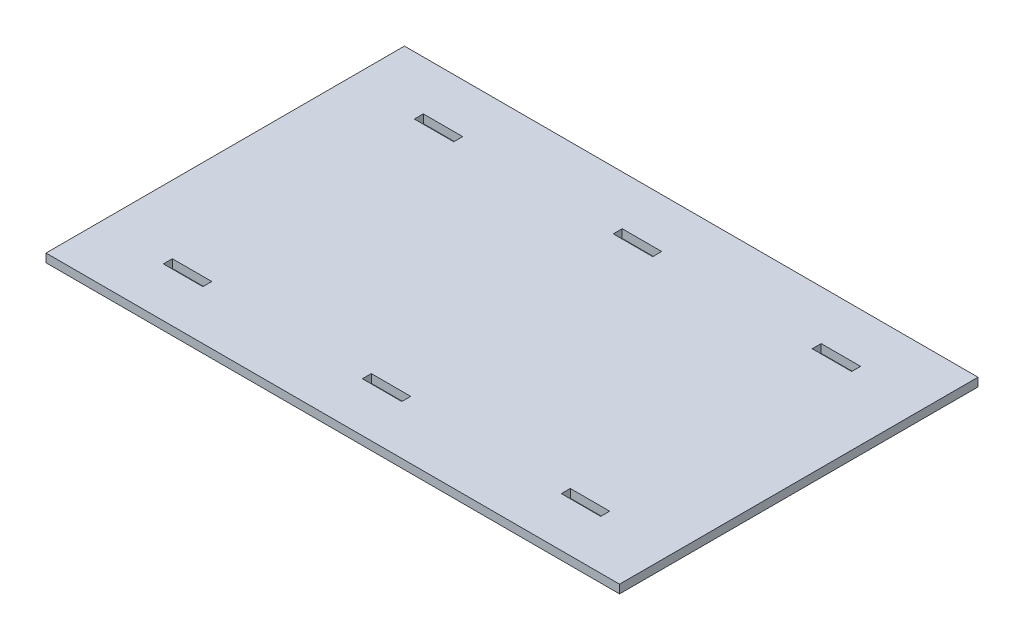
ISO-10303-21;
HEADER;
FILE_DESCRIPTION(('STEP AP214'),'2;1');
FILE_NAME('part.step','',(''),(''),'','','');
FILE_SCHEMA(('AUTOMOTIVE_DESIGN { 1 0 10303 214 1 1 1 1 }'));
ENDSEC;
DATA;
#1=APPLICATION_CONTEXT('core data for automotive mechanical design processes');
#2=APPLICATION_PROTOCOL_DEFINITION('international standard','automotive_design',2000,#1);
#3=PRODUCT_CONTEXT('',#1,'mechanical');
#4=PRODUCT('Part','Part','',(#3));
#5=PRODUCT_RELATED_PRODUCT_CATEGORY('part','',(#4));
#6=PRODUCT_DEFINITION_FORMATION('','',#4);
#7=PRODUCT_DEFINITION_CONTEXT('part definition',#1,'design');
#8=PRODUCT_DEFINITION('design','',#6,#7);
#9=PRODUCT_DEFINITION_SHAPE('','',#8);
#10=(LENGTH_UNIT() NAMED_UNIT(*) SI_UNIT(.MILLI.,.METRE.));
#11=(NAMED_UNIT(*) PLANE_ANGLE_UNIT() SI_UNIT($,.RADIAN.));
#12=(NAMED_UNIT(*) SI_UNIT($,.STERADIAN.) SOLID_ANGLE_UNIT());
#13=UNCERTAINTY_MEASURE_WITH_UNIT(LENGTH_MEASURE(1.E-05),#10,'distance_accuracy_value','');
#14=(GEOMETRIC_REPRESENTATION_CONTEXT(3) GLOBAL_UNCERTAINTY_ASSIGNED_CONTEXT((#13)) GLOBAL_UNIT_ASSIGNED_CONTEXT((#10,
#11,#12)) REPRESENTATION_CONTEXT('',''));
#15=CARTESIAN_POINT('',(0.,0.,0.));
#16=DIRECTION('',(0.,0.,1.));
#17=DIRECTION('',(1.,0.,0.));
#18=AXIS2_PLACEMENT_3D('',#15,#16,#17);
#19=CARTESIAN_POINT('',(101.6,2.9972,63.5));
#20=DIRECTION('',(-1.,0.,0.));
#21=DIRECTION('',(0.,0.,1.));
#22=AXIS2_PLACEMENT_3D('',#19,#20,#21);
#23=PLANE('',#22);
#24=DIRECTION('',(0.,0.,-1.));
#25=VECTOR('',#24,1.);
#26=CARTESIAN_POINT('',(101.6,0.,63.5));
#27=LINE('',#26,#25);
#28=CARTESIAN_POINT('',(101.6,0.,63.5));
#29=VERTEX_POINT('',#28);
#30=CARTESIAN_POINT('',(101.6,0.,-63.5));
#31=VERTEX_POINT('',#30);
#32=EDGE_CURVE('E404',#29,#31,#27,.T.);
#33=ORIENTED_EDGE('',*,*,#32,.T.);
#34=DIRECTION('',(0.,-1.,0.));
#35=VECTOR('',#34,1.);
#36=CARTESIAN_POINT('',(101.6,2.9972,-63.5));
#37=LINE('',#36,#35);
#38=CARTESIAN_POINT('',(101.6,2.9972,-63.5));
#39=VERTEX_POINT('',#38);
#40=EDGE_CURVE('E11',#39,#31,#37,.T.);
#41=ORIENTED_EDGE('',*,*,#40,.F.);
#42=DIRECTION('',(0.,0.,-1.));
#43=VECTOR('',#42,1.);
#44=CARTESIAN_POINT('',(101.6,2.9972,63.5));
#45=LINE('',#44,#43);
#46=CARTESIAN_POINT('',(101.6,2.9972,63.5));
#47=VERTEX_POINT('',#46);
#48=EDGE_CURVE('E411',#47,#39,#45,.T.);
#49=ORIENTED_EDGE('',*,*,#48,.F.);
#50=DIRECTION('',(0.,-1.,0.));
#51=VECTOR('',#50,1.);
#52=CARTESIAN_POINT('',(101.6,2.9972,63.5));
#53=LINE('',#52,#51);
#54=EDGE_CURVE('E421',#47,#29,#53,.T.);
#55=ORIENTED_EDGE('',*,*,#54,.T.);
#56=EDGE_LOOP('',(#33,#41,#49,#55));
#57=FACE_BOUND('',#56,.T.);
#58=ADVANCED_FACE('F30',(#57),#23,.F.);
#59=CARTESIAN_POINT('',(-101.6,2.9972,-63.5));
#60=DIRECTION('',(0.,0.,1.));
#61=DIRECTION('',(1.,0.,0.));
#62=AXIS2_PLACEMENT_3D('',#59,#60,#61);
#63=PLANE('',#62);
#64=DIRECTION('',(-1.,0.,0.));
#65=VECTOR('',#64,1.);
#66=CARTESIAN_POINT('',(-101.6,0.,-63.5));
#67=LINE('',#66,#65);
#68=CARTESIAN_POINT('',(-101.6,0.,-63.5));
#69=VERTEX_POINT('',#68);
#70=EDGE_CURVE('E424',#31,#69,#67,.T.);
#71=ORIENTED_EDGE('',*,*,#70,.T.);
#72=DIRECTION('',(0.,-1.,0.));
#73=VECTOR('',#72,1.);
#74=CARTESIAN_POINT('',(-101.6,2.9972,-63.5));
#75=LINE('',#74,#73);
#76=CARTESIAN_POINT('',(-101.6,2.9972,-63.5));
#77=VERTEX_POINT('',#76);
#78=EDGE_CURVE('E37',#77,#69,#75,.T.);
#79=ORIENTED_EDGE('',*,*,#78,.F.);
#80=DIRECTION('',(-1.,0.,0.));
#81=VECTOR('',#80,1.);
#82=CARTESIAN_POINT('',(-101.6,2.9972,-63.5));
#83=LINE('',#82,#81);
#84=EDGE_CURVE('E414',#39,#77,#83,.T.);
#85=ORIENTED_EDGE('',*,*,#84,.F.);
#86=ORIENTED_EDGE('',*,*,#40,.T.);
#87=EDGE_LOOP('',(#71,#79,#85,#86));
#88=FACE_BOUND('',#87,.T.);
#89=ADVANCED_FACE('F453',(#88),#63,.F.);
#90=CARTESIAN_POINT('',(-101.6,2.9972,63.5));
#91=DIRECTION('',(1.,0.,0.));
#92=DIRECTION('',(0.,0.,-1.));
#93=AXIS2_PLACEMENT_3D('',#90,#91,#92);
#94=PLANE('',#93);
#95=DIRECTION('',(0.,0.,1.));
#96=VECTOR('',#95,1.);
#97=CARTESIAN_POINT('',(-101.6,0.,63.5));
#98=LINE('',#97,#96);
#99=CARTESIAN_POINT('',(-101.6,0.,63.5));
#100=VERTEX_POINT('',#99);
#101=EDGE_CURVE('E426',#69,#100,#98,.T.);
#102=ORIENTED_EDGE('',*,*,#101,.T.);
#103=DIRECTION('',(0.,-1.,0.));
#104=VECTOR('',#103,1.);
#105=CARTESIAN_POINT('',(-101.6,2.9972,63.5));
#106=LINE('',#105,#104);
#107=CARTESIAN_POINT('',(-101.6,2.9972,63.5));
#108=VERTEX_POINT('',#107);
#109=EDGE_CURVE('E431',#108,#100,#106,.T.);
#110=ORIENTED_EDGE('',*,*,#109,.F.);
#111=DIRECTION('',(0.,0.,1.));
#112=VECTOR('',#111,1.);
#113=CARTESIAN_POINT('',(-101.6,2.9972,63.5));
#114=LINE('',#113,#112);
#115=EDGE_CURVE('E417',#77,#108,#114,.T.);
#116=ORIENTED_EDGE('',*,*,#115,.F.);
#117=ORIENTED_EDGE('',*,*,#78,.T.);
#118=EDGE_LOOP('',(#102,#110,#116,#117));
#119=FACE_BOUND('',#118,.T.);
#120=ADVANCED_FACE('F438',(#119),#94,.F.);
#121=CARTESIAN_POINT('',(-101.6,2.9972,63.5));
#122=DIRECTION('',(0.,0.,-1.));
#123=DIRECTION('',(-1.,0.,0.));
#124=AXIS2_PLACEMENT_3D('',#121,#122,#123);
#125=PLANE('',#124);
#126=DIRECTION('',(1.,0.,0.));
#127=VECTOR('',#126,1.);
#128=CARTESIAN_POINT('',(-101.6,0.,63.5));
#129=LINE('',#128,#127);
#130=EDGE_CURVE('E415',#100,#29,#129,.T.);
#131=ORIENTED_EDGE('',*,*,#130,.T.);
#132=ORIENTED_EDGE('',*,*,#54,.F.);
#133=DIRECTION('',(1.,0.,0.));
#134=VECTOR('',#133,1.);
#135=CARTESIAN_POINT('',(-101.6,2.9972,63.5));
#136=LINE('',#135,#134);
#137=EDGE_CURVE('E419',#108,#47,#136,.T.);
#138=ORIENTED_EDGE('',*,*,#137,.F.);
#139=ORIENTED_EDGE('',*,*,#109,.T.);
#140=EDGE_LOOP('',(#131,#132,#138,#139));
#141=FACE_BOUND('',#140,.T.);
#142=ADVANCED_FACE('F446',(#141),#125,.F.);
#143=CARTESIAN_POINT('',(101.6,2.9972,-63.5));
#144=DIRECTION('',(0.,-1.,0.));
#145=DIRECTION('',(0.,0.,-1.));
#146=AXIS2_PLACEMENT_3D('',#143,#144,#145);
#147=PLANE('',#146);
#148=DIRECTION('',(0.,0.,-1.));
#149=VECTOR('',#148,1.);
#150=CARTESIAN_POINT('',(-63.5,2.9972,46.0375));
#151=LINE('',#150,#149);
#152=CARTESIAN_POINT('',(-63.5,2.9972,46.0375));
#153=VERTEX_POINT('',#152);
#154=CARTESIAN_POINT('',(-63.5,2.9972,42.8625));
#155=VERTEX_POINT('',#154);
#156=EDGE_CURVE('E241',#153,#155,#151,.T.);
#157=ORIENTED_EDGE('',*,*,#156,.F.);
#158=DIRECTION('',(1.,0.,0.));
#159=VECTOR('',#158,1.);
#160=CARTESIAN_POINT('',(-77.47,2.9972,46.0375));
#161=LINE('',#160,#159);
#162=CARTESIAN_POINT('',(-77.47,2.9972,46.0375));
#163=VERTEX_POINT('',#162);
#164=EDGE_CURVE('E44',#163,#153,#161,.T.);
#165=ORIENTED_EDGE('',*,*,#164,.F.);
#166=DIRECTION('',(0.,0.,1.));
#167=VECTOR('',#166,1.);
#168=CARTESIAN_POINT('',(-77.47,2.9972,46.0375));
#169=LINE('',#168,#167);
#170=CARTESIAN_POINT('',(-77.47,2.9972,42.8625));
#171=VERTEX_POINT('',#170);
#172=EDGE_CURVE('E232',#171,#163,#169,.T.);
#173=ORIENTED_EDGE('',*,*,#172,.F.);
#174=DIRECTION('',(-1.,0.,0.));
#175=VECTOR('',#174,1.);
#176=CARTESIAN_POINT('',(-77.47,2.9972,42.8625));
#177=LINE('',#176,#175);
#178=EDGE_CURVE('E235',#155,#171,#177,.T.);
#179=ORIENTED_EDGE('',*,*,#178,.F.);
#180=EDGE_LOOP('',(#157,#165,#173,#179));
#181=FACE_BOUND('',#180,.T.);
#182=DIRECTION('',(-1.,0.,0.));
#183=VECTOR('',#182,1.);
#184=CARTESIAN_POINT('',(77.47,2.9972,42.8625));
#185=LINE('',#184,#183);
#186=CARTESIAN_POINT('',(77.47,2.9972,42.8625));
#187=VERTEX_POINT('',#186);
#188=CARTESIAN_POINT('',(63.5,2.9972,42.8625));
#189=VERTEX_POINT('',#188);
#190=EDGE_CURVE('E266',#187,#189,#185,.T.);
#191=ORIENTED_EDGE('',*,*,#190,.F.);
#192=DIRECTION('',(0.,0.,-1.));
#193=VECTOR('',#192,1.);
#194=CARTESIAN_POINT('',(77.47,2.9972,46.0375));
#195=LINE('',#194,#193);
#196=CARTESIAN_POINT('',(77.47,2.9972,46.0375));
#197=VERTEX_POINT('',#196);
#198=EDGE_CURVE('E247',#197,#187,#195,.T.);
#199=ORIENTED_EDGE('',*,*,#198,.F.);
#200=DIRECTION('',(1.,0.,0.));
#201=VECTOR('',#200,1.);
#202=CARTESIAN_POINT('',(77.47,2.9972,46.0375));
#203=LINE('',#202,#201);
#204=CARTESIAN_POINT('',(63.5,2.9972,46.0375));
#205=VERTEX_POINT('',#204);
#206=EDGE_CURVE('E255',#205,#197,#203,.T.);
#207=ORIENTED_EDGE('',*,*,#206,.F.);
#208=DIRECTION('',(0.,0.,1.));
#209=VECTOR('',#208,1.);
#210=CARTESIAN_POINT('',(63.5,2.9972,46.0375));
#211=LINE('',#210,#209);
#212=EDGE_CURVE('E269',#189,#205,#211,.T.);
#213=ORIENTED_EDGE('',*,*,#212,.F.);
#214=EDGE_LOOP('',(#191,#199,#207,#213));
#215=FACE_BOUND('',#214,.T.);
#216=DIRECTION('',(1.,0.,0.));
#217=VECTOR('',#216,1.);
#218=CARTESIAN_POINT('',(-6.98499999999999,2.9972,46.0375));
#219=LINE('',#218,#217);
#220=CARTESIAN_POINT('',(-6.98499999999999,2.9972,46.0375));
#221=VERTEX_POINT('',#220);
#222=CARTESIAN_POINT('',(6.98500000000001,2.9972,46.0375));
#223=VERTEX_POINT('',#222);
#224=EDGE_CURVE('E298',#221,#223,#219,.T.);
#225=ORIENTED_EDGE('',*,*,#224,.F.);
#226=DIRECTION('',(0.,0.,1.));
#227=VECTOR('',#226,1.);
#228=CARTESIAN_POINT('',(-6.98499999999999,2.9972,46.0375));
#229=LINE('',#228,#227);
#230=CARTESIAN_POINT('',(-6.98499999999999,2.9972,42.8625));
#231=VERTEX_POINT('',#230);
#232=EDGE_CURVE('E276',#231,#221,#229,.T.);
#233=ORIENTED_EDGE('',*,*,#232,.F.);
#234=DIRECTION('',(-1.,0.,0.));
#235=VECTOR('',#234,1.);
#236=CARTESIAN_POINT('',(-6.98499999999999,2.9972,42.8625));
#237=LINE('',#236,#235);
#238=CARTESIAN_POINT('',(6.98500000000001,2.9972,42.8625));
#239=VERTEX_POINT('',#238);
#240=EDGE_CURVE('E287',#239,#231,#237,.T.);
#241=ORIENTED_EDGE('',*,*,#240,.F.);
#242=DIRECTION('',(0.,0.,-1.));
#243=VECTOR('',#242,1.);
#244=CARTESIAN_POINT('',(6.98500000000001,2.9972,46.0375));
#245=LINE('',#244,#243);
#246=EDGE_CURVE('E301',#223,#239,#245,.T.);
#247=ORIENTED_EDGE('',*,*,#246,.F.);
#248=EDGE_LOOP('',(#225,#233,#241,#247));
#249=FACE_BOUND('',#248,.T.);
#250=DIRECTION('',(0.,0.,1.));
#251=VECTOR('',#250,1.);
#252=CARTESIAN_POINT('',(63.5,2.9972,-46.0375));
#253=LINE('',#252,#251);
#254=CARTESIAN_POINT('',(63.5,2.9972,-46.0375));
#255=VERTEX_POINT('',#254);
#256=CARTESIAN_POINT('',(63.5,2.9972,-42.8625));
#257=VERTEX_POINT('',#256);
#258=EDGE_CURVE('E330',#255,#257,#253,.T.);
#259=ORIENTED_EDGE('',*,*,#258,.F.);
#260=DIRECTION('',(-1.,0.,0.));
#261=VECTOR('',#260,1.);
#262=CARTESIAN_POINT('',(77.47,2.9972,-46.0375));
#263=LINE('',#262,#261);
#264=CARTESIAN_POINT('',(77.47,2.9972,-46.0375));
#265=VERTEX_POINT('',#264);
#266=EDGE_CURVE('E308',#265,#255,#263,.T.);
#267=ORIENTED_EDGE('',*,*,#266,.F.);
#268=DIRECTION('',(0.,0.,-1.));
#269=VECTOR('',#268,1.);
#270=CARTESIAN_POINT('',(77.47,2.9972,-46.0375));
#271=LINE('',#270,#269);
#272=CARTESIAN_POINT('',(77.47,2.9972,-42.8625));
#273=VERTEX_POINT('',#272);
#274=EDGE_CURVE('E319',#273,#265,#271,.T.);
#275=ORIENTED_EDGE('',*,*,#274,.F.);
#276=DIRECTION('',(1.,0.,0.));
#277=VECTOR('',#276,1.);
#278=CARTESIAN_POINT('',(77.47,2.9972,-42.8625));
#279=LINE('',#278,#277);
#280=EDGE_CURVE('E333',#257,#273,#279,.T.);
#281=ORIENTED_EDGE('',*,*,#280,.F.);
#282=EDGE_LOOP('',(#259,#267,#275,#281));
#283=FACE_BOUND('',#282,.T.);
#284=DIRECTION('',(-1.,0.,0.));
#285=VECTOR('',#284,1.);
#286=CARTESIAN_POINT('',(-6.98499999999999,2.9972,-46.0375));
#287=LINE('',#286,#285);
#288=CARTESIAN_POINT('',(6.985,2.9972,-46.0375));
#289=VERTEX_POINT('',#288);
#290=CARTESIAN_POINT('',(-6.98499999999999,2.9972,-46.0375));
#291=VERTEX_POINT('',#290);
#292=EDGE_CURVE('E362',#289,#291,#287,.T.);
#293=ORIENTED_EDGE('',*,*,#292,.F.);
#294=DIRECTION('',(0.,0.,-1.));
#295=VECTOR('',#294,1.);
#296=CARTESIAN_POINT('',(6.98500000000001,2.9972,-46.0375));
#297=LINE('',#296,#295);
#298=CARTESIAN_POINT('',(6.98500000000001,2.9972,-42.8625));
#299=VERTEX_POINT('',#298);
#300=EDGE_CURVE('E340',#299,#289,#297,.T.);
#301=ORIENTED_EDGE('',*,*,#300,.F.);
#302=DIRECTION('',(1.,0.,0.));
#303=VECTOR('',#302,1.);
#304=CARTESIAN_POINT('',(-6.98499999999999,2.9972,-42.8625));
#305=LINE('',#304,#303);
#306=CARTESIAN_POINT('',(-6.98499999999999,2.9972,-42.8625));
#307=VERTEX_POINT('',#306);
#308=EDGE_CURVE('E351',#307,#299,#305,.T.);
#309=ORIENTED_EDGE('',*,*,#308,.F.);
#310=DIRECTION('',(0.,0.,1.));
#311=VECTOR('',#310,1.);
#312=CARTESIAN_POINT('',(-6.98499999999999,2.9972,-46.0375));
#313=LINE('',#312,#311);
#314=EDGE_CURVE('E365',#291,#307,#313,.T.);
#315=ORIENTED_EDGE('',*,*,#314,.F.);
#316=EDGE_LOOP('',(#293,#301,#309,#315));
#317=FACE_BOUND('',#316,.T.);
#318=DIRECTION('',(1.,0.,0.));
#319=VECTOR('',#318,1.);
#320=CARTESIAN_POINT('',(-77.47,2.9972,-42.8625));
#321=LINE('',#320,#319);
#322=CARTESIAN_POINT('',(-77.47,2.9972,-42.8625));
#323=VERTEX_POINT('',#322);
#324=CARTESIAN_POINT('',(-63.5,2.9972,-42.8625));
#325=VERTEX_POINT('',#324);
#326=EDGE_CURVE('E394',#323,#325,#321,.T.);
#327=ORIENTED_EDGE('',*,*,#326,.F.);
#328=DIRECTION('',(0.,0.,1.));
#329=VECTOR('',#328,1.);
#330=CARTESIAN_POINT('',(-77.47,2.9972,-46.0375));
#331=LINE('',#330,#329);
#332=CARTESIAN_POINT('',(-77.47,2.9972,-46.0375));
#333=VERTEX_POINT('',#332);
#334=EDGE_CURVE('E372',#333,#323,#331,.T.);
#335=ORIENTED_EDGE('',*,*,#334,.F.);
#336=DIRECTION('',(-1.,0.,0.));
#337=VECTOR('',#336,1.);
#338=CARTESIAN_POINT('',(-77.47,2.9972,-46.0375));
#339=LINE('',#338,#337);
#340=CARTESIAN_POINT('',(-63.5,2.9972,-46.0375));
#341=VERTEX_POINT('',#340);
#342=EDGE_CURVE('E383',#341,#333,#339,.T.);
#343=ORIENTED_EDGE('',*,*,#342,.F.);
#344=DIRECTION('',(0.,0.,-1.));
#345=VECTOR('',#344,1.);
#346=CARTESIAN_POINT('',(-63.5,2.9972,-46.0375));
#347=LINE('',#346,#345);
#348=EDGE_CURVE('E397',#325,#341,#347,.T.);
#349=ORIENTED_EDGE('',*,*,#348,.F.);
#350=EDGE_LOOP('',(#327,#335,#343,#349));
#351=FACE_BOUND('',#350,.T.);
#352=ORIENTED_EDGE('',*,*,#48,.T.);
#353=ORIENTED_EDGE('',*,*,#84,.T.);
#354=ORIENTED_EDGE('',*,*,#115,.T.);
#355=ORIENTED_EDGE('',*,*,#137,.T.);
#356=EDGE_LOOP('',(#352,#353,#354,#355));
#357=FACE_BOUND('',#356,.T.);
#358=ADVANCED_FACE('F452',(#181,#215,#249,#283,#317,#351,#357),#147,.F.);
#359=CARTESIAN_POINT('',(101.6,0.,-63.5));
#360=DIRECTION('',(0.,-1.,0.));
#361=DIRECTION('',(0.,0.,-1.));
#362=AXIS2_PLACEMENT_3D('',#359,#360,#361);
#363=PLANE('',#362);
#364=DIRECTION('',(1.,0.,0.));
#365=VECTOR('',#364,1.);
#366=CARTESIAN_POINT('',(-77.47,0.,46.0375));
#367=LINE('',#366,#365);
#368=CARTESIAN_POINT('',(-77.47,0.,46.0375));
#369=VERTEX_POINT('',#368);
#370=CARTESIAN_POINT('',(-63.5,0.,46.0375));
#371=VERTEX_POINT('',#370);
#372=EDGE_CURVE('E216',#369,#371,#367,.T.);
#373=ORIENTED_EDGE('',*,*,#372,.T.);
#374=DIRECTION('',(0.,0.,-1.));
#375=VECTOR('',#374,1.);
#376=CARTESIAN_POINT('',(-63.5,0.,46.0375));
#377=LINE('',#376,#375);
#378=CARTESIAN_POINT('',(-63.5,0.,42.8625));
#379=VERTEX_POINT('',#378);
#380=EDGE_CURVE('E225',#371,#379,#377,.T.);
#381=ORIENTED_EDGE('',*,*,#380,.T.);
#382=DIRECTION('',(-1.,0.,0.));
#383=VECTOR('',#382,1.);
#384=CARTESIAN_POINT('',(-77.47,0.,42.8625));
#385=LINE('',#384,#383);
#386=CARTESIAN_POINT('',(-77.47,0.,42.8625));
#387=VERTEX_POINT('',#386);
#388=EDGE_CURVE('E52',#379,#387,#385,.T.);
#389=ORIENTED_EDGE('',*,*,#388,.T.);
#390=DIRECTION('',(0.,0.,1.));
#391=VECTOR('',#390,1.);
#392=CARTESIAN_POINT('',(-77.47,0.,46.0375));
#393=LINE('',#392,#391);
#394=EDGE_CURVE('E222',#387,#369,#393,.T.);
#395=ORIENTED_EDGE('',*,*,#394,.T.);
#396=EDGE_LOOP('',(#373,#381,#389,#395));
#397=FACE_BOUND('',#396,.T.);
#398=DIRECTION('',(0.,0.,-1.));
#399=VECTOR('',#398,1.);
#400=CARTESIAN_POINT('',(77.47,0.,46.0375));
#401=LINE('',#400,#399);
#402=CARTESIAN_POINT('',(77.47,0.,46.0375));
#403=VERTEX_POINT('',#402);
#404=CARTESIAN_POINT('',(77.47,0.,42.8625));
#405=VERTEX_POINT('',#404);
#406=EDGE_CURVE('E251',#403,#405,#401,.T.);
#407=ORIENTED_EDGE('',*,*,#406,.T.);
#408=DIRECTION('',(-1.,0.,0.));
#409=VECTOR('',#408,1.);
#410=CARTESIAN_POINT('',(77.47,0.,42.8625));
#411=LINE('',#410,#409);
#412=CARTESIAN_POINT('',(63.5,0.,42.8625));
#413=VERTEX_POINT('',#412);
#414=EDGE_CURVE('E254',#405,#413,#411,.T.);
#415=ORIENTED_EDGE('',*,*,#414,.T.);
#416=DIRECTION('',(0.,0.,1.));
#417=VECTOR('',#416,1.);
#418=CARTESIAN_POINT('',(63.5,0.,46.0375));
#419=LINE('',#418,#417);
#420=CARTESIAN_POINT('',(63.5,0.,46.0375));
#421=VERTEX_POINT('',#420);
#422=EDGE_CURVE('E258',#413,#421,#419,.T.);
#423=ORIENTED_EDGE('',*,*,#422,.T.);
#424=DIRECTION('',(1.,0.,0.));
#425=VECTOR('',#424,1.);
#426=CARTESIAN_POINT('',(77.47,0.,46.0375));
#427=LINE('',#426,#425);
#428=EDGE_CURVE('E261',#421,#403,#427,.T.);
#429=ORIENTED_EDGE('',*,*,#428,.T.);
#430=EDGE_LOOP('',(#407,#415,#423,#429));
#431=FACE_BOUND('',#430,.T.);
#432=DIRECTION('',(0.,0.,1.));
#433=VECTOR('',#432,1.);
#434=CARTESIAN_POINT('',(-6.98499999999999,0.,46.0375));
#435=LINE('',#434,#433);
#436=CARTESIAN_POINT('',(-6.98499999999999,0.,42.8625));
#437=VERTEX_POINT('',#436);
#438=CARTESIAN_POINT('',(-6.98499999999999,0.,46.0375));
#439=VERTEX_POINT('',#438);
#440=EDGE_CURVE('E283',#437,#439,#435,.T.);
#441=ORIENTED_EDGE('',*,*,#440,.T.);
#442=DIRECTION('',(1.,0.,0.));
#443=VECTOR('',#442,1.);
#444=CARTESIAN_POINT('',(-6.98499999999999,0.,46.0375));
#445=LINE('',#444,#443);
#446=CARTESIAN_POINT('',(6.985,0.,46.0375));
#447=VERTEX_POINT('',#446);
#448=EDGE_CURVE('E286',#439,#447,#445,.T.);
#449=ORIENTED_EDGE('',*,*,#448,.T.);
#450=DIRECTION('',(0.,0.,-1.));
#451=VECTOR('',#450,1.);
#452=CARTESIAN_POINT('',(6.98500000000001,0.,46.0375));
#453=LINE('',#452,#451);
#454=CARTESIAN_POINT('',(6.98500000000001,0.,42.8625));
#455=VERTEX_POINT('',#454);
#456=EDGE_CURVE('E290',#447,#455,#453,.T.);
#457=ORIENTED_EDGE('',*,*,#456,.T.);
#458=DIRECTION('',(-1.,0.,0.));
#459=VECTOR('',#458,1.);
#460=CARTESIAN_POINT('',(-6.98499999999999,0.,42.8625));
#461=LINE('',#460,#459);
#462=EDGE_CURVE('E293',#455,#437,#461,.T.);
#463=ORIENTED_EDGE('',*,*,#462,.T.);
#464=EDGE_LOOP('',(#441,#449,#457,#463));
#465=FACE_BOUND('',#464,.T.);
#466=DIRECTION('',(-1.,0.,0.));
#467=VECTOR('',#466,1.);
#468=CARTESIAN_POINT('',(77.47,0.,-46.0375));
#469=LINE('',#468,#467);
#470=CARTESIAN_POINT('',(77.47,0.,-46.0375));
#471=VERTEX_POINT('',#470);
#472=CARTESIAN_POINT('',(63.5,0.,-46.0375));
#473=VERTEX_POINT('',#472);
#474=EDGE_CURVE('E315',#471,#473,#469,.T.);
#475=ORIENTED_EDGE('',*,*,#474,.T.);
#476=DIRECTION('',(0.,0.,1.));
#477=VECTOR('',#476,1.);
#478=CARTESIAN_POINT('',(63.5,0.,-46.0375));
#479=LINE('',#478,#477);
#480=CARTESIAN_POINT('',(63.5,0.,-42.8625));
#481=VERTEX_POINT('',#480);
#482=EDGE_CURVE('E318',#473,#481,#479,.T.);
#483=ORIENTED_EDGE('',*,*,#482,.T.);
#484=DIRECTION('',(1.,0.,0.));
#485=VECTOR('',#484,1.);
#486=CARTESIAN_POINT('',(77.47,0.,-42.8625));
#487=LINE('',#486,#485);
#488=CARTESIAN_POINT('',(77.47,0.,-42.8625));
#489=VERTEX_POINT('',#488);
#490=EDGE_CURVE('E322',#481,#489,#487,.T.);
#491=ORIENTED_EDGE('',*,*,#490,.T.);
#492=DIRECTION('',(0.,0.,-1.));
#493=VECTOR('',#492,1.);
#494=CARTESIAN_POINT('',(77.47,0.,-46.0375));
#495=LINE('',#494,#493);
#496=EDGE_CURVE('E325',#489,#471,#495,.T.);
#497=ORIENTED_EDGE('',*,*,#496,.T.);
#498=EDGE_LOOP('',(#475,#483,#491,#497));
#499=FACE_BOUND('',#498,.T.);
#500=DIRECTION('',(0.,0.,-1.));
#501=VECTOR('',#500,1.);
#502=CARTESIAN_POINT('',(6.98500000000001,0.,-46.0375));
#503=LINE('',#502,#501);
#504=CARTESIAN_POINT('',(6.98500000000001,0.,-42.8625));
#505=VERTEX_POINT('',#504);
#506=CARTESIAN_POINT('',(6.98500000000001,0.,-46.0375));
#507=VERTEX_POINT('',#506);
#508=EDGE_CURVE('E347',#505,#507,#503,.T.);
#509=ORIENTED_EDGE('',*,*,#508,.T.);
#510=DIRECTION('',(-1.,0.,0.));
#511=VECTOR('',#510,1.);
#512=CARTESIAN_POINT('',(-6.98499999999999,0.,-46.0375));
#513=LINE('',#512,#511);
#514=CARTESIAN_POINT('',(-6.98499999999999,0.,-46.0375));
#515=VERTEX_POINT('',#514);
#516=EDGE_CURVE('E350',#507,#515,#513,.T.);
#517=ORIENTED_EDGE('',*,*,#516,.T.);
#518=DIRECTION('',(0.,0.,1.));
#519=VECTOR('',#518,1.);
#520=CARTESIAN_POINT('',(-6.98499999999999,0.,-46.0375));
#521=LINE('',#520,#519);
#522=CARTESIAN_POINT('',(-6.98499999999999,0.,-42.8625));
#523=VERTEX_POINT('',#522);
#524=EDGE_CURVE('E354',#515,#523,#521,.T.);
#525=ORIENTED_EDGE('',*,*,#524,.T.);
#526=DIRECTION('',(1.,0.,0.));
#527=VECTOR('',#526,1.);
#528=CARTESIAN_POINT('',(-6.98499999999999,0.,-42.8625));
#529=LINE('',#528,#527);
#530=EDGE_CURVE('E357',#523,#505,#529,.T.);
#531=ORIENTED_EDGE('',*,*,#530,.T.);
#532=EDGE_LOOP('',(#509,#517,#525,#531));
#533=FACE_BOUND('',#532,.T.);
#534=DIRECTION('',(0.,0.,1.));
#535=VECTOR('',#534,1.);
#536=CARTESIAN_POINT('',(-77.47,0.,-46.0375));
#537=LINE('',#536,#535);
#538=CARTESIAN_POINT('',(-77.47,0.,-46.0375));
#539=VERTEX_POINT('',#538);
#540=CARTESIAN_POINT('',(-77.47,0.,-42.8625));
#541=VERTEX_POINT('',#540);
#542=EDGE_CURVE('E379',#539,#541,#537,.T.);
#543=ORIENTED_EDGE('',*,*,#542,.T.);
#544=DIRECTION('',(1.,0.,0.));
#545=VECTOR('',#544,1.);
#546=CARTESIAN_POINT('',(-77.47,0.,-42.8625));
#547=LINE('',#546,#545);
#548=CARTESIAN_POINT('',(-63.5,0.,-42.8625));
#549=VERTEX_POINT('',#548);
#550=EDGE_CURVE('E382',#541,#549,#547,.T.);
#551=ORIENTED_EDGE('',*,*,#550,.T.);
#552=DIRECTION('',(0.,0.,-1.));
#553=VECTOR('',#552,1.);
#554=CARTESIAN_POINT('',(-63.5,0.,-46.0375));
#555=LINE('',#554,#553);
#556=CARTESIAN_POINT('',(-63.5,0.,-46.0375));
#557=VERTEX_POINT('',#556);
#558=EDGE_CURVE('E386',#549,#557,#555,.T.);
#559=ORIENTED_EDGE('',*,*,#558,.T.);
#560=DIRECTION('',(-1.,0.,0.));
#561=VECTOR('',#560,1.);
#562=CARTESIAN_POINT('',(-77.47,0.,-46.0375));
#563=LINE('',#562,#561);
#564=EDGE_CURVE('E389',#557,#539,#563,.T.);
#565=ORIENTED_EDGE('',*,*,#564,.T.);
#566=EDGE_LOOP('',(#543,#551,#559,#565));
#567=FACE_BOUND('',#566,.T.);
#568=ORIENTED_EDGE('',*,*,#32,.F.);
#569=ORIENTED_EDGE('',*,*,#130,.F.);
#570=ORIENTED_EDGE('',*,*,#101,.F.);
#571=ORIENTED_EDGE('',*,*,#70,.F.);
#572=EDGE_LOOP('',(#568,#569,#570,#571));
#573=FACE_BOUND('',#572,.T.);
#574=ADVANCED_FACE('F229',(#397,#431,#465,#499,#533,#567,#573),#363,.T.);
#575=CARTESIAN_POINT('',(-77.47,0.,-46.0375));
#576=DIRECTION('',(-1.,0.,0.));
#577=DIRECTION('',(0.,0.,1.));
#578=AXIS2_PLACEMENT_3D('',#575,#576,#577);
#579=PLANE('',#578);
#580=ORIENTED_EDGE('',*,*,#334,.T.);
#581=DIRECTION('',(0.,1.,0.));
#582=VECTOR('',#581,1.);
#583=CARTESIAN_POINT('',(-77.47,0.,-42.8625));
#584=LINE('',#583,#582);
#585=EDGE_CURVE('E392',#541,#323,#584,.T.);
#586=ORIENTED_EDGE('',*,*,#585,.F.);
#587=ORIENTED_EDGE('',*,*,#542,.F.);
#588=DIRECTION('',(0.,1.,0.));
#589=VECTOR('',#588,1.);
#590=CARTESIAN_POINT('',(-77.47,0.,-46.0375));
#591=LINE('',#590,#589);
#592=EDGE_CURVE('E402',#539,#333,#591,.T.);
#593=ORIENTED_EDGE('',*,*,#592,.T.);
#594=EDGE_LOOP('',(#580,#586,#587,#593));
#595=FACE_BOUND('',#594,.T.);
#596=ADVANCED_FACE('F465',(#595),#579,.F.);
#597=CARTESIAN_POINT('',(-77.47,0.,-46.0375));
#598=DIRECTION('',(0.,0.,-1.));
#599=DIRECTION('',(-1.,0.,0.));
#600=AXIS2_PLACEMENT_3D('',#597,#598,#599);
#601=PLANE('',#600);
#602=ORIENTED_EDGE('',*,*,#342,.T.);
#603=ORIENTED_EDGE('',*,*,#592,.F.);
#604=ORIENTED_EDGE('',*,*,#564,.F.);
#605=DIRECTION('',(0.,1.,0.));
#606=VECTOR('',#605,1.);
#607=CARTESIAN_POINT('',(-63.5,0.,-46.0375));
#608=LINE('',#607,#606);
#609=EDGE_CURVE('E405',#557,#341,#608,.T.);
#610=ORIENTED_EDGE('',*,*,#609,.T.);
#611=EDGE_LOOP('',(#602,#603,#604,#610));
#612=FACE_BOUND('',#611,.T.);
#613=ADVANCED_FACE('F471',(#612),#601,.F.);
#614=CARTESIAN_POINT('',(-63.5,0.,-46.0375));
#615=DIRECTION('',(1.,0.,0.));
#616=DIRECTION('',(0.,0.,-1.));
#617=AXIS2_PLACEMENT_3D('',#614,#615,#616);
#618=PLANE('',#617);
#619=ORIENTED_EDGE('',*,*,#348,.T.);
#620=ORIENTED_EDGE('',*,*,#609,.F.);
#621=ORIENTED_EDGE('',*,*,#558,.F.);
#622=DIRECTION('',(0.,1.,0.));
#623=VECTOR('',#622,1.);
#624=CARTESIAN_POINT('',(-63.5,0.,-42.8625));
#625=LINE('',#624,#623);
#626=EDGE_CURVE('E407',#549,#325,#625,.T.);
#627=ORIENTED_EDGE('',*,*,#626,.T.);
#628=EDGE_LOOP('',(#619,#620,#621,#627));
#629=FACE_BOUND('',#628,.T.);
#630=ADVANCED_FACE('F477',(#629),#618,.F.);
#631=CARTESIAN_POINT('',(-77.47,0.,-42.8625));
#632=DIRECTION('',(0.,0.,1.));
#633=DIRECTION('',(1.,0.,0.));
#634=AXIS2_PLACEMENT_3D('',#631,#632,#633);
#635=PLANE('',#634);
#636=ORIENTED_EDGE('',*,*,#326,.T.);
#637=ORIENTED_EDGE('',*,*,#626,.F.);
#638=ORIENTED_EDGE('',*,*,#550,.F.);
#639=ORIENTED_EDGE('',*,*,#585,.T.);
#640=EDGE_LOOP('',(#636,#637,#638,#639));
#641=FACE_BOUND('',#640,.T.);
#642=ADVANCED_FACE('F473',(#641),#635,.F.);
#643=CARTESIAN_POINT('',(6.98500000000001,0.,-46.0375));
#644=DIRECTION('',(1.,0.,0.));
#645=DIRECTION('',(0.,0.,-1.));
#646=AXIS2_PLACEMENT_3D('',#643,#644,#645);
#647=PLANE('',#646);
#648=ORIENTED_EDGE('',*,*,#300,.T.);
#649=DIRECTION('',(0.,1.,0.));
#650=VECTOR('',#649,1.);
#651=CARTESIAN_POINT('',(6.98500000000001,0.,-46.0375));
#652=LINE('',#651,#650);
#653=EDGE_CURVE('E360',#507,#289,#652,.T.);
#654=ORIENTED_EDGE('',*,*,#653,.F.);
#655=ORIENTED_EDGE('',*,*,#508,.F.);
#656=DIRECTION('',(0.,1.,0.));
#657=VECTOR('',#656,1.);
#658=CARTESIAN_POINT('',(6.98500000000001,0.,-42.8625));
#659=LINE('',#658,#657);
#660=EDGE_CURVE('E370',#505,#299,#659,.T.);
#661=ORIENTED_EDGE('',*,*,#660,.T.);
#662=EDGE_LOOP('',(#648,#654,#655,#661));
#663=FACE_BOUND('',#662,.T.);
#664=ADVANCED_FACE('F476',(#663),#647,.F.);
#665=CARTESIAN_POINT('',(-6.98499999999999,0.,-42.8625));
#666=DIRECTION('',(0.,0.,1.));
#667=DIRECTION('',(1.,0.,0.));
#668=AXIS2_PLACEMENT_3D('',#665,#666,#667);
#669=PLANE('',#668);
#670=ORIENTED_EDGE('',*,*,#308,.T.);
#671=ORIENTED_EDGE('',*,*,#660,.F.);
#672=ORIENTED_EDGE('',*,*,#530,.F.);
#673=DIRECTION('',(0.,1.,0.));
#674=VECTOR('',#673,1.);
#675=CARTESIAN_POINT('',(-6.98499999999999,0.,-42.8625));
#676=LINE('',#675,#674);
#677=EDGE_CURVE('E373',#523,#307,#676,.T.);
#678=ORIENTED_EDGE('',*,*,#677,.T.);
#679=EDGE_LOOP('',(#670,#671,#672,#678));
#680=FACE_BOUND('',#679,.T.);
#681=ADVANCED_FACE('F487',(#680),#669,.F.);
#682=CARTESIAN_POINT('',(-6.98499999999999,0.,-46.0375));
#683=DIRECTION('',(-1.,0.,0.));
#684=DIRECTION('',(0.,0.,1.));
#685=AXIS2_PLACEMENT_3D('',#682,#683,#684);
#686=PLANE('',#685);
#687=ORIENTED_EDGE('',*,*,#314,.T.);
#688=ORIENTED_EDGE('',*,*,#677,.F.);
#689=ORIENTED_EDGE('',*,*,#524,.F.);
#690=DIRECTION('',(0.,1.,0.));
#691=VECTOR('',#690,1.);
#692=CARTESIAN_POINT('',(-6.98499999999999,0.,-46.0375));
#693=LINE('',#692,#691);
#694=EDGE_CURVE('E375',#515,#291,#693,.T.);
#695=ORIENTED_EDGE('',*,*,#694,.T.);
#696=EDGE_LOOP('',(#687,#688,#689,#695));
#697=FACE_BOUND('',#696,.T.);
#698=ADVANCED_FACE('F493',(#697),#686,.F.);
#699=CARTESIAN_POINT('',(-6.98499999999999,0.,-46.0375));
#700=DIRECTION('',(0.,0.,-1.));
#701=DIRECTION('',(-1.,0.,0.));
#702=AXIS2_PLACEMENT_3D('',#699,#700,#701);
#703=PLANE('',#702);
#704=ORIENTED_EDGE('',*,*,#292,.T.);
#705=ORIENTED_EDGE('',*,*,#694,.F.);
#706=ORIENTED_EDGE('',*,*,#516,.F.);
#707=ORIENTED_EDGE('',*,*,#653,.T.);
#708=EDGE_LOOP('',(#704,#705,#706,#707));
#709=FACE_BOUND('',#708,.T.);
#710=ADVANCED_FACE('F489',(#709),#703,.F.);
#711=CARTESIAN_POINT('',(77.47,0.,-46.0375));
#712=DIRECTION('',(0.,0.,-1.));
#713=DIRECTION('',(-1.,0.,0.));
#714=AXIS2_PLACEMENT_3D('',#711,#712,#713);
#715=PLANE('',#714);
#716=ORIENTED_EDGE('',*,*,#266,.T.);
#717=DIRECTION('',(0.,1.,0.));
#718=VECTOR('',#717,1.);
#719=CARTESIAN_POINT('',(63.5,0.,-46.0375));
#720=LINE('',#719,#718);
#721=EDGE_CURVE('E328',#473,#255,#720,.T.);
#722=ORIENTED_EDGE('',*,*,#721,.F.);
#723=ORIENTED_EDGE('',*,*,#474,.F.);
#724=DIRECTION('',(0.,1.,0.));
#725=VECTOR('',#724,1.);
#726=CARTESIAN_POINT('',(77.47,0.,-46.0375));
#727=LINE('',#726,#725);
#728=EDGE_CURVE('E338',#471,#265,#727,.T.);
#729=ORIENTED_EDGE('',*,*,#728,.T.);
#730=EDGE_LOOP('',(#716,#722,#723,#729));
#731=FACE_BOUND('',#730,.T.);
#732=ADVANCED_FACE('F492',(#731),#715,.F.);
#733=CARTESIAN_POINT('',(77.47,0.,-46.0375));
#734=DIRECTION('',(1.,0.,0.));
#735=DIRECTION('',(0.,0.,-1.));
#736=AXIS2_PLACEMENT_3D('',#733,#734,#735);
#737=PLANE('',#736);
#738=ORIENTED_EDGE('',*,*,#274,.T.);
#739=ORIENTED_EDGE('',*,*,#728,.F.);
#740=ORIENTED_EDGE('',*,*,#496,.F.);
#741=DIRECTION('',(0.,1.,0.));
#742=VECTOR('',#741,1.);
#743=CARTESIAN_POINT('',(77.47,0.,-42.8625));
#744=LINE('',#743,#742);
#745=EDGE_CURVE('E341',#489,#273,#744,.T.);
#746=ORIENTED_EDGE('',*,*,#745,.T.);
#747=EDGE_LOOP('',(#738,#739,#740,#746));
#748=FACE_BOUND('',#747,.T.);
#749=ADVANCED_FACE('F503',(#748),#737,.F.);
#750=CARTESIAN_POINT('',(77.47,0.,-42.8625));
#751=DIRECTION('',(0.,0.,1.));
#752=DIRECTION('',(1.,0.,0.));
#753=AXIS2_PLACEMENT_3D('',#750,#751,#752);
#754=PLANE('',#753);
#755=ORIENTED_EDGE('',*,*,#280,.T.);
#756=ORIENTED_EDGE('',*,*,#745,.F.);
#757=ORIENTED_EDGE('',*,*,#490,.F.);
#758=DIRECTION('',(0.,1.,0.));
#759=VECTOR('',#758,1.);
#760=CARTESIAN_POINT('',(63.5,0.,-42.8625));
#761=LINE('',#760,#759);
#762=EDGE_CURVE('E343',#481,#257,#761,.T.);
#763=ORIENTED_EDGE('',*,*,#762,.T.);
#764=EDGE_LOOP('',(#755,#756,#757,#763));
#765=FACE_BOUND('',#764,.T.);
#766=ADVANCED_FACE('F509',(#765),#754,.F.);
#767=CARTESIAN_POINT('',(63.5,0.,-46.0375));
#768=DIRECTION('',(-1.,0.,0.));
#769=DIRECTION('',(0.,0.,1.));
#770=AXIS2_PLACEMENT_3D('',#767,#768,#769);
#771=PLANE('',#770);
#772=ORIENTED_EDGE('',*,*,#258,.T.);
#773=ORIENTED_EDGE('',*,*,#762,.F.);
#774=ORIENTED_EDGE('',*,*,#482,.F.);
#775=ORIENTED_EDGE('',*,*,#721,.T.);
#776=EDGE_LOOP('',(#772,#773,#774,#775));
#777=FACE_BOUND('',#776,.T.);
#778=ADVANCED_FACE('F505',(#777),#771,.F.);
#779=CARTESIAN_POINT('',(-6.98499999999999,0.,46.0375));
#780=DIRECTION('',(-1.,0.,0.));
#781=DIRECTION('',(0.,0.,1.));
#782=AXIS2_PLACEMENT_3D('',#779,#780,#781);
#783=PLANE('',#782);
#784=ORIENTED_EDGE('',*,*,#232,.T.);
#785=DIRECTION('',(0.,1.,0.));
#786=VECTOR('',#785,1.);
#787=CARTESIAN_POINT('',(-6.98499999999999,0.,46.0375));
#788=LINE('',#787,#786);
#789=EDGE_CURVE('E296',#439,#221,#788,.T.);
#790=ORIENTED_EDGE('',*,*,#789,.F.);
#791=ORIENTED_EDGE('',*,*,#440,.F.);
#792=DIRECTION('',(0.,1.,0.));
#793=VECTOR('',#792,1.);
#794=CARTESIAN_POINT('',(-6.98499999999999,0.,42.8625));
#795=LINE('',#794,#793);
#796=EDGE_CURVE('E306',#437,#231,#795,.T.);
#797=ORIENTED_EDGE('',*,*,#796,.T.);
#798=EDGE_LOOP('',(#784,#790,#791,#797));
#799=FACE_BOUND('',#798,.T.);
#800=ADVANCED_FACE('F508',(#799),#783,.F.);
#801=CARTESIAN_POINT('',(-6.98499999999999,0.,42.8625));
#802=DIRECTION('',(0.,0.,-1.));
#803=DIRECTION('',(-1.,0.,0.));
#804=AXIS2_PLACEMENT_3D('',#801,#802,#803);
#805=PLANE('',#804);
#806=ORIENTED_EDGE('',*,*,#240,.T.);
#807=ORIENTED_EDGE('',*,*,#796,.F.);
#808=ORIENTED_EDGE('',*,*,#462,.F.);
#809=DIRECTION('',(0.,1.,0.));
#810=VECTOR('',#809,1.);
#811=CARTESIAN_POINT('',(6.98500000000001,0.,42.8625));
#812=LINE('',#811,#810);
#813=EDGE_CURVE('E309',#455,#239,#812,.T.);
#814=ORIENTED_EDGE('',*,*,#813,.T.);
#815=EDGE_LOOP('',(#806,#807,#808,#814));
#816=FACE_BOUND('',#815,.T.);
#817=ADVANCED_FACE('F519',(#816),#805,.F.);
#818=CARTESIAN_POINT('',(6.98500000000001,0.,46.0375));
#819=DIRECTION('',(1.,0.,0.));
#820=DIRECTION('',(0.,0.,-1.));
#821=AXIS2_PLACEMENT_3D('',#818,#819,#820);
#822=PLANE('',#821);
#823=ORIENTED_EDGE('',*,*,#246,.T.);
#824=ORIENTED_EDGE('',*,*,#813,.F.);
#825=ORIENTED_EDGE('',*,*,#456,.F.);
#826=DIRECTION('',(0.,1.,0.));
#827=VECTOR('',#826,1.);
#828=CARTESIAN_POINT('',(6.98500000000001,0.,46.0375));
#829=LINE('',#828,#827);
#830=EDGE_CURVE('E311',#447,#223,#829,.T.);
#831=ORIENTED_EDGE('',*,*,#830,.T.);
#832=EDGE_LOOP('',(#823,#824,#825,#831));
#833=FACE_BOUND('',#832,.T.);
#834=ADVANCED_FACE('F525',(#833),#822,.F.);
#835=CARTESIAN_POINT('',(-6.98499999999999,0.,46.0375));
#836=DIRECTION('',(0.,0.,1.));
#837=DIRECTION('',(1.,0.,0.));
#838=AXIS2_PLACEMENT_3D('',#835,#836,#837);
#839=PLANE('',#838);
#840=ORIENTED_EDGE('',*,*,#224,.T.);
#841=ORIENTED_EDGE('',*,*,#830,.F.);
#842=ORIENTED_EDGE('',*,*,#448,.F.);
#843=ORIENTED_EDGE('',*,*,#789,.T.);
#844=EDGE_LOOP('',(#840,#841,#842,#843));
#845=FACE_BOUND('',#844,.T.);
#846=ADVANCED_FACE('F521',(#845),#839,.F.);
#847=CARTESIAN_POINT('',(77.47,0.,46.0375));
#848=DIRECTION('',(1.,0.,0.));
#849=DIRECTION('',(0.,0.,-1.));
#850=AXIS2_PLACEMENT_3D('',#847,#848,#849);
#851=PLANE('',#850);
#852=ORIENTED_EDGE('',*,*,#198,.T.);
#853=DIRECTION('',(0.,1.,0.));
#854=VECTOR('',#853,1.);
#855=CARTESIAN_POINT('',(77.47,0.,42.8625));
#856=LINE('',#855,#854);
#857=EDGE_CURVE('E264',#405,#187,#856,.T.);
#858=ORIENTED_EDGE('',*,*,#857,.F.);
#859=ORIENTED_EDGE('',*,*,#406,.F.);
#860=DIRECTION('',(0.,1.,0.));
#861=VECTOR('',#860,1.);
#862=CARTESIAN_POINT('',(77.47,0.,46.0375));
#863=LINE('',#862,#861);
#864=EDGE_CURVE('E274',#403,#197,#863,.T.);
#865=ORIENTED_EDGE('',*,*,#864,.T.);
#866=EDGE_LOOP('',(#852,#858,#859,#865));
#867=FACE_BOUND('',#866,.T.);
#868=ADVANCED_FACE('F524',(#867),#851,.F.);
#869=CARTESIAN_POINT('',(77.47,0.,46.0375));
#870=DIRECTION('',(0.,0.,1.));
#871=DIRECTION('',(1.,0.,0.));
#872=AXIS2_PLACEMENT_3D('',#869,#870,#871);
#873=PLANE('',#872);
#874=ORIENTED_EDGE('',*,*,#206,.T.);
#875=ORIENTED_EDGE('',*,*,#864,.F.);
#876=ORIENTED_EDGE('',*,*,#428,.F.);
#877=DIRECTION('',(0.,1.,0.));
#878=VECTOR('',#877,1.);
#879=CARTESIAN_POINT('',(63.5,0.,46.0375));
#880=LINE('',#879,#878);
#881=EDGE_CURVE('E277',#421,#205,#880,.T.);
#882=ORIENTED_EDGE('',*,*,#881,.T.);
#883=EDGE_LOOP('',(#874,#875,#876,#882));
#884=FACE_BOUND('',#883,.T.);
#885=ADVANCED_FACE('F535',(#884),#873,.F.);
#886=CARTESIAN_POINT('',(63.5,0.,46.0375));
#887=DIRECTION('',(-1.,0.,0.));
#888=DIRECTION('',(0.,0.,1.));
#889=AXIS2_PLACEMENT_3D('',#886,#887,#888);
#890=PLANE('',#889);
#891=ORIENTED_EDGE('',*,*,#212,.T.);
#892=ORIENTED_EDGE('',*,*,#881,.F.);
#893=ORIENTED_EDGE('',*,*,#422,.F.);
#894=DIRECTION('',(0.,1.,0.));
#895=VECTOR('',#894,1.);
#896=CARTESIAN_POINT('',(63.5,0.,42.8625));
#897=LINE('',#896,#895);
#898=EDGE_CURVE('E279',#413,#189,#897,.T.);
#899=ORIENTED_EDGE('',*,*,#898,.T.);
#900=EDGE_LOOP('',(#891,#892,#893,#899));
#901=FACE_BOUND('',#900,.T.);
#902=ADVANCED_FACE('F540',(#901),#890,.F.);
#903=CARTESIAN_POINT('',(77.47,0.,42.8625));
#904=DIRECTION('',(0.,0.,-1.));
#905=DIRECTION('',(-1.,0.,0.));
#906=AXIS2_PLACEMENT_3D('',#903,#904,#905);
#907=PLANE('',#906);
#908=ORIENTED_EDGE('',*,*,#190,.T.);
#909=ORIENTED_EDGE('',*,*,#898,.F.);
#910=ORIENTED_EDGE('',*,*,#414,.F.);
#911=ORIENTED_EDGE('',*,*,#857,.T.);
#912=EDGE_LOOP('',(#908,#909,#910,#911));
#913=FACE_BOUND('',#912,.T.);
#914=ADVANCED_FACE('F537',(#913),#907,.F.);
#915=CARTESIAN_POINT('',(-77.47,0.,46.0375));
#916=DIRECTION('',(0.,0.,1.));
#917=DIRECTION('',(1.,0.,0.));
#918=AXIS2_PLACEMENT_3D('',#915,#916,#917);
#919=PLANE('',#918);
#920=ORIENTED_EDGE('',*,*,#164,.T.);
#921=DIRECTION('',(0.,1.,0.));
#922=VECTOR('',#921,1.);
#923=CARTESIAN_POINT('',(-63.5,0.,46.0375));
#924=LINE('',#923,#922);
#925=EDGE_CURVE('E212',#371,#153,#924,.T.);
#926=ORIENTED_EDGE('',*,*,#925,.F.);
#927=ORIENTED_EDGE('',*,*,#372,.F.);
#928=DIRECTION('',(0.,1.,0.));
#929=VECTOR('',#928,1.);
#930=CARTESIAN_POINT('',(-77.47,0.,46.0375));
#931=LINE('',#930,#929);
#932=EDGE_CURVE('E245',#369,#163,#931,.T.);
#933=ORIENTED_EDGE('',*,*,#932,.T.);
#934=EDGE_LOOP('',(#920,#926,#927,#933));
#935=FACE_BOUND('',#934,.T.);
#936=ADVANCED_FACE('F214',(#935),#919,.F.);
#937=CARTESIAN_POINT('',(-77.47,0.,46.0375));
#938=DIRECTION('',(-1.,0.,0.));
#939=DIRECTION('',(0.,0.,1.));
#940=AXIS2_PLACEMENT_3D('',#937,#938,#939);
#941=PLANE('',#940);
#942=ORIENTED_EDGE('',*,*,#172,.T.);
#943=ORIENTED_EDGE('',*,*,#932,.F.);
#944=ORIENTED_EDGE('',*,*,#394,.F.);
#945=DIRECTION('',(0.,1.,0.));
#946=VECTOR('',#945,1.);
#947=CARTESIAN_POINT('',(-77.47,0.,42.8625));
#948=LINE('',#947,#946);
#949=EDGE_CURVE('E248',#387,#171,#948,.T.);
#950=ORIENTED_EDGE('',*,*,#949,.T.);
#951=EDGE_LOOP('',(#942,#943,#944,#950));
#952=FACE_BOUND('',#951,.T.);
#953=ADVANCED_FACE('F550',(#952),#941,.F.);
#954=CARTESIAN_POINT('',(-77.47,0.,42.8625));
#955=DIRECTION('',(0.,0.,-1.));
#956=DIRECTION('',(-1.,0.,0.));
#957=AXIS2_PLACEMENT_3D('',#954,#955,#956);
#958=PLANE('',#957);
#959=ORIENTED_EDGE('',*,*,#178,.T.);
#960=ORIENTED_EDGE('',*,*,#949,.F.);
#961=ORIENTED_EDGE('',*,*,#388,.F.);
#962=DIRECTION('',(0.,1.,0.));
#963=VECTOR('',#962,1.);
#964=CARTESIAN_POINT('',(-63.5,0.,42.8625));
#965=LINE('',#964,#963);
#966=EDGE_CURVE('E221',#379,#155,#965,.T.);
#967=ORIENTED_EDGE('',*,*,#966,.T.);
#968=EDGE_LOOP('',(#959,#960,#961,#967));
#969=FACE_BOUND('',#968,.T.);
#970=ADVANCED_FACE('F553',(#969),#958,.F.);
#971=CARTESIAN_POINT('',(-63.5,0.,46.0375));
#972=DIRECTION('',(1.,0.,0.));
#973=DIRECTION('',(0.,0.,-1.));
#974=AXIS2_PLACEMENT_3D('',#971,#972,#973);
#975=PLANE('',#974);
#976=ORIENTED_EDGE('',*,*,#156,.T.);
#977=ORIENTED_EDGE('',*,*,#966,.F.);
#978=ORIENTED_EDGE('',*,*,#380,.F.);
#979=ORIENTED_EDGE('',*,*,#925,.T.);
#980=EDGE_LOOP('',(#976,#977,#978,#979));
#981=FACE_BOUND('',#980,.T.);
#982=ADVANCED_FACE('F226',(#981),#975,.F.);
#983=CLOSED_SHELL('',(#58,#89,#120,#142,#358,#574,#596,#613,#630,#642,#664,#681,#698,#710,#732,
#749,#766,#778,#800,#817,#834,#846,#868,#885,#902,#914,#936,#953,#970,#982));
#984=MANIFOLD_SOLID_BREP('B2',#983);
#985=ADVANCED_BREP_SHAPE_REPRESENTATION('',(#18,#984),#14);
#986=SHAPE_DEFINITION_REPRESENTATION(#9,#985);
ENDSEC;
END-ISO-10303-21;
